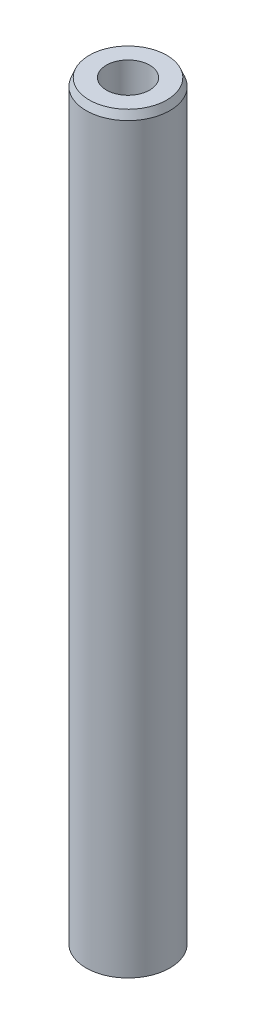
ISO-10303-21;
HEADER;
FILE_DESCRIPTION(('STEP AP214'),'2;1');
FILE_NAME('part.step','',(''),(''),'','','');
FILE_SCHEMA(('AUTOMOTIVE_DESIGN { 1 0 10303 214 1 1 1 1 }'));
ENDSEC;
DATA;
#1=APPLICATION_CONTEXT('core data for automotive mechanical design processes');
#2=APPLICATION_PROTOCOL_DEFINITION('international standard','automotive_design',2000,#1);
#3=PRODUCT_CONTEXT('',#1,'mechanical');
#4=PRODUCT('Part','Part','',(#3));
#5=PRODUCT_RELATED_PRODUCT_CATEGORY('part','',(#4));
#6=PRODUCT_DEFINITION_FORMATION('','',#4);
#7=PRODUCT_DEFINITION_CONTEXT('part definition',#1,'design');
#8=PRODUCT_DEFINITION('design','',#6,#7);
#9=PRODUCT_DEFINITION_SHAPE('','',#8);
#10=(LENGTH_UNIT() NAMED_UNIT(*) SI_UNIT(.MILLI.,.METRE.));
#11=(NAMED_UNIT(*) PLANE_ANGLE_UNIT() SI_UNIT($,.RADIAN.));
#12=(NAMED_UNIT(*) SI_UNIT($,.STERADIAN.) SOLID_ANGLE_UNIT());
#13=UNCERTAINTY_MEASURE_WITH_UNIT(LENGTH_MEASURE(1.E-05),#10,'distance_accuracy_value','');
#14=(GEOMETRIC_REPRESENTATION_CONTEXT(3) GLOBAL_UNCERTAINTY_ASSIGNED_CONTEXT((#13)) GLOBAL_UNIT_ASSIGNED_CONTEXT((#10,
#11,#12)) REPRESENTATION_CONTEXT('',''));
#15=CARTESIAN_POINT('',(0.,0.,0.));
#16=DIRECTION('',(0.,0.,1.));
#17=DIRECTION('',(1.,0.,0.));
#18=AXIS2_PLACEMENT_3D('',#15,#16,#17);
#19=CARTESIAN_POINT('',(0.,314.982312778485,0.));
#20=DIRECTION('',(0.,-1.,0.));
#21=DIRECTION('',(0.,0.,-1.));
#22=AXIS2_PLACEMENT_3D('',#19,#20,#21);
#23=CYLINDRICAL_SURFACE('',#22,17.5);
#24=CARTESIAN_POINT('',(0.,311.779967379057,0.));
#25=DIRECTION('',(0.,1.,0.));
#26=DIRECTION('',(0.,0.,1.));
#27=AXIS2_PLACEMENT_3D('',#24,#25,#26);
#28=CIRCLE('',#27,17.5);
#29=CARTESIAN_POINT('',(0.,311.779967379057,-17.5));
#30=VERTEX_POINT('',#29);
#31=EDGE_CURVE('E50',#30,#30,#28,.F.);
#32=ORIENTED_EDGE('',*,*,#31,.T.);
#33=EDGE_LOOP('',(#32));
#34=FACE_BOUND('',#33,.T.);
#35=CARTESIAN_POINT('',(0.,1.28796307959911,0.));
#36=DIRECTION('',(0.,1.,0.));
#37=DIRECTION('',(0.,0.,1.));
#38=AXIS2_PLACEMENT_3D('',#35,#36,#37);
#39=CIRCLE('',#38,17.5);
#40=CARTESIAN_POINT('',(0.,1.28796307959911,17.5));
#41=VERTEX_POINT('',#40);
#42=EDGE_CURVE('E51',#41,#41,#39,.T.);
#43=ORIENTED_EDGE('',*,*,#42,.T.);
#44=EDGE_LOOP('',(#43));
#45=FACE_BOUND('',#44,.T.);
#46=ADVANCED_FACE('F39',(#34,#45),#23,.T.);
#47=CARTESIAN_POINT('',(0.,314.982312778485,0.));
#48=DIRECTION('',(0.,1.,0.));
#49=DIRECTION('',(0.,0.,1.));
#50=AXIS2_PLACEMENT_3D('',#47,#48,#49);
#51=PLANE('',#50);
#52=CARTESIAN_POINT('',(0.,314.982312778485,0.));
#53=DIRECTION('',(0.,1.,0.));
#54=DIRECTION('',(0.,0.,1.));
#55=AXIS2_PLACEMENT_3D('',#52,#53,#54);
#56=CIRCLE('',#55,16.2120369204008);
#57=CARTESIAN_POINT('',(0.,314.982312778485,-16.2120369204008));
#58=VERTEX_POINT('',#57);
#59=EDGE_CURVE('E54',#58,#58,#56,.T.);
#60=ORIENTED_EDGE('',*,*,#59,.T.);
#61=EDGE_LOOP('',(#60));
#62=FACE_BOUND('',#61,.T.);
#63=CARTESIAN_POINT('',(0.,314.982312778485,0.));
#64=DIRECTION('',(0.,1.,0.));
#65=DIRECTION('',(0.,0.,1.));
#66=AXIS2_PLACEMENT_3D('',#63,#64,#65);
#67=CIRCLE('',#66,9.05307027082447);
#68=CARTESIAN_POINT('',(0.,314.982312778485,9.05307027082447));
#69=VERTEX_POINT('',#68);
#70=EDGE_CURVE('E58',#69,#69,#67,.T.);
#71=ORIENTED_EDGE('',*,*,#70,.F.);
#72=EDGE_LOOP('',(#71));
#73=FACE_BOUND('',#72,.T.);
#74=ADVANCED_FACE('F69',(#62,#73),#51,.T.);
#75=CARTESIAN_POINT('',(0.,0.,0.));
#76=DIRECTION('',(0.,1.,0.));
#77=DIRECTION('',(0.,0.,1.));
#78=AXIS2_PLACEMENT_3D('',#75,#76,#77);
#79=PLANE('',#78);
#80=CARTESIAN_POINT('',(0.,0.,0.));
#81=DIRECTION('',(0.,1.,0.));
#82=DIRECTION('',(0.,0.,1.));
#83=AXIS2_PLACEMENT_3D('',#80,#81,#82);
#84=CIRCLE('',#83,14.297654600573);
#85=CARTESIAN_POINT('',(0.,0.,14.297654600573));
#86=VERTEX_POINT('',#85);
#87=EDGE_CURVE('E10',#86,#86,#84,.F.);
#88=ORIENTED_EDGE('',*,*,#87,.T.);
#89=EDGE_LOOP('',(#88));
#90=FACE_BOUND('',#89,.T.);
#91=CARTESIAN_POINT('',(0.,0.,0.));
#92=DIRECTION('',(0.,1.,0.));
#93=DIRECTION('',(0.,0.,1.));
#94=AXIS2_PLACEMENT_3D('',#91,#92,#93);
#95=CIRCLE('',#94,9.05307027082447);
#96=CARTESIAN_POINT('',(0.,0.,9.05307027082447));
#97=VERTEX_POINT('',#96);
#98=EDGE_CURVE('E63',#97,#97,#95,.T.);
#99=ORIENTED_EDGE('',*,*,#98,.T.);
#100=EDGE_LOOP('',(#99));
#101=FACE_BOUND('',#100,.T.);
#102=ADVANCED_FACE('F75',(#90,#101),#79,.F.);
#103=CARTESIAN_POINT('',(0.,314.982312778485,0.));
#104=DIRECTION('',(0.,-1.,0.));
#105=DIRECTION('',(0.,0.,-1.));
#106=AXIS2_PLACEMENT_3D('',#103,#104,#105);
#107=CYLINDRICAL_SURFACE('',#106,9.05307027082447);
#108=ORIENTED_EDGE('',*,*,#70,.T.);
#109=EDGE_LOOP('',(#108));
#110=FACE_BOUND('',#109,.T.);
#111=ORIENTED_EDGE('',*,*,#98,.F.);
#112=EDGE_LOOP('',(#111));
#113=FACE_BOUND('',#112,.T.);
#114=ADVANCED_FACE('F70',(#110,#113),#107,.F.);
#115=CARTESIAN_POINT('',(0.,314.982312778485,0.));
#116=DIRECTION('',(0.,-1.,0.));
#117=DIRECTION('',(0.,0.,-1.));
#118=AXIS2_PLACEMENT_3D('',#115,#116,#117);
#119=CONICAL_SURFACE('',#118,16.2120369204008,0.382396048553831);
#120=CARTESIAN_POINT('',(0.,311.779967379057,-17.5));
#121=CARTESIAN_POINT('',(0.,311.813325143635,-17.4865837179209));
#122=CARTESIAN_POINT('',(0.,311.846682908212,-17.4731674358417));
#123=CARTESIAN_POINT('',(0.,311.913398437367,-17.4463348716834));
#124=CARTESIAN_POINT('',(0.,311.946756201944,-17.4329185896042));
#125=CARTESIAN_POINT('',(0.,312.013471731099,-17.4060860254459));
#126=CARTESIAN_POINT('',(0.,312.046829495676,-17.3926697433667));
#127=CARTESIAN_POINT('',(0.,312.113545024831,-17.3658371792084));
#128=CARTESIAN_POINT('',(0.,312.146902789409,-17.3524208971293));
#129=CARTESIAN_POINT('',(0.,312.213618318563,-17.325588332971));
#130=CARTESIAN_POINT('',(0.,312.246976083141,-17.3121720508918));
#131=CARTESIAN_POINT('',(0.,312.313691612295,-17.2853394867335));
#132=CARTESIAN_POINT('',(0.,312.347049376873,-17.2719232046543));
#133=CARTESIAN_POINT('',(0.,312.413764906027,-17.245090640496));
#134=CARTESIAN_POINT('',(0.,312.447122670605,-17.2316743584168));
#135=CARTESIAN_POINT('',(0.,312.51383819976,-17.2048417942585));
#136=CARTESIAN_POINT('',(0.,312.547195964337,-17.1914255121794));
#137=CARTESIAN_POINT('',(0.,312.613911493492,-17.1645929480211));
#138=CARTESIAN_POINT('',(0.,312.647269258069,-17.1511766659419));
#139=CARTESIAN_POINT('',(0.,312.713984787224,-17.1243441017836));
#140=CARTESIAN_POINT('',(0.,312.747342551801,-17.1109278197044));
#141=CARTESIAN_POINT('',(0.,312.814058080956,-17.0840952555461));
#142=CARTESIAN_POINT('',(0.,312.847415845533,-17.0706789734669));
#143=CARTESIAN_POINT('',(0.,312.914131374688,-17.0438464093086));
#144=CARTESIAN_POINT('',(0.,312.947489139265,-17.0304301272295));
#145=CARTESIAN_POINT('',(0.,313.01420466842,-17.0035975630711));
#146=CARTESIAN_POINT('',(0.,313.047562432997,-16.990181280992));
#147=CARTESIAN_POINT('',(0.,313.114277962152,-16.9633487168337));
#148=CARTESIAN_POINT('',(0.,313.14763572673,-16.9499324347545));
#149=CARTESIAN_POINT('',(0.,313.214351255884,-16.9230998705962));
#150=CARTESIAN_POINT('',(0.,313.247709020462,-16.909683588517));
#151=CARTESIAN_POINT('',(0.,313.314424549616,-16.8828510243587));
#152=CARTESIAN_POINT('',(0.,313.347782314194,-16.8694347422796));
#153=CARTESIAN_POINT('',(0.,313.414497843348,-16.8426021781213));
#154=CARTESIAN_POINT('',(0.,313.447855607926,-16.8291858960421));
#155=CARTESIAN_POINT('',(0.,313.51457113708,-16.8023533318838));
#156=CARTESIAN_POINT('',(0.,313.547928901658,-16.7889370498046));
#157=CARTESIAN_POINT('',(0.,313.614644430813,-16.7621044856463));
#158=CARTESIAN_POINT('',(0.,313.64800219539,-16.7486882035671));
#159=CARTESIAN_POINT('',(0.,313.714717724545,-16.7218556394088));
#160=CARTESIAN_POINT('',(0.,313.748075489122,-16.7084393573297));
#161=CARTESIAN_POINT('',(0.,313.814791018277,-16.6816067931714));
#162=CARTESIAN_POINT('',(0.,313.848148782854,-16.6681905110922));
#163=CARTESIAN_POINT('',(0.,313.914864312009,-16.6413579469339));
#164=CARTESIAN_POINT('',(0.,313.948222076586,-16.6279416648547));
#165=CARTESIAN_POINT('',(0.,314.014937605741,-16.6011091006964));
#166=CARTESIAN_POINT('',(0.,314.048295370318,-16.5876928186172));
#167=CARTESIAN_POINT('',(0.,314.115010899473,-16.5608602544589));
#168=CARTESIAN_POINT('',(0.,314.148368664051,-16.5474439723798));
#169=CARTESIAN_POINT('',(0.,314.215084193205,-16.5206114082215));
#170=CARTESIAN_POINT('',(0.,314.248441957783,-16.5071951261423));
#171=CARTESIAN_POINT('',(0.,314.315157486937,-16.480362561984));
#172=CARTESIAN_POINT('',(0.,314.348515251515,-16.4669462799048));
#173=CARTESIAN_POINT('',(0.,314.415230780669,-16.4401137157465));
#174=CARTESIAN_POINT('',(0.,314.448588545247,-16.4266974336673));
#175=CARTESIAN_POINT('',(0.,314.515304074401,-16.399864869509));
#176=CARTESIAN_POINT('',(0.,314.548661838979,-16.3864485874299));
#177=CARTESIAN_POINT('',(0.,314.615377368134,-16.3596160232716));
#178=CARTESIAN_POINT('',(0.,314.648735132711,-16.3461997411924));
#179=CARTESIAN_POINT('',(0.,314.715450661866,-16.3193671770341));
#180=CARTESIAN_POINT('',(0.,314.748808426443,-16.3059508949549));
#181=CARTESIAN_POINT('',(0.,314.815523955598,-16.2791183307966));
#182=CARTESIAN_POINT('',(0.,314.848881720175,-16.2657020487174));
#183=CARTESIAN_POINT('',(0.,314.91559724933,-16.2388694845591));
#184=CARTESIAN_POINT('',(0.,314.948955013907,-16.22545320248));
#185=CARTESIAN_POINT('',(0.,314.982312778485,-16.2120369204008));
#186=B_SPLINE_CURVE_WITH_KNOTS('',3,(#120,#121,#122,#123,#124,#125,#126,#127,#128,#129,#130,
#131,#132,#133,#134,#135,#136,#137,#138,#139,#140,#141,#142,#143,#144,#145,#146,#147,#148,#149,
#150,#151,#152,#153,#154,#155,#156,#157,#158,#159,#160,#161,#162,#163,#164,#165,#166,#167,#168,
#169,#170,#171,#172,#173,#174,#175,#176,#177,#178,#179,#180,#181,#182,#183,#184,#185),
.UNSPECIFIED.,.F.,.F.,(4,2,2,2,2,2,2,2,2,2,2,2,2,2,2,2,2,2,2,2,2,2,2,2,2,2,2,2,2,2,2,2,4),(0.,
0.107863959420344,0.215727918840688,0.323591878261084,0.431455837681426,0.539319797101822,
0.647183756522166,0.755047715942561,0.862911675362905,0.970775634783301,1.07863959420364,
1.18650355362404,1.29436751304438,1.40223147246478,1.51009543188512,1.61795939130552,
1.72582335072586,1.83368731014621,1.9415512695666,2.04941522898695,2.15727918840734,
2.26514314782769,2.37300710724808,2.48087106666843,2.58873502608882,2.69659898550916,
2.80446294492956,2.9123269043499,3.0201908637703,3.12805482319064,3.23591878261104,
3.34378274203138,3.45164670145178),.UNSPECIFIED.);
#187=EDGE_CURVE('BSEAM81',#30,#58,#186,.T.);
#188=ORIENTED_EDGE('',*,*,#31,.F.);
#189=ORIENTED_EDGE('',*,*,#59,.F.);
#190=ORIENTED_EDGE('',*,*,#187,.T.);
#191=ORIENTED_EDGE('',*,*,#187,.F.);
#192=EDGE_LOOP('',(#188,#190,#189,#191));
#193=FACE_BOUND('',#192,.T.);
#194=ADVANCED_FACE('F81',(#193),#119,.T.);
#195=CARTESIAN_POINT('',(0.,1.28796307959911,0.));
#196=DIRECTION('',(0.,1.,0.));
#197=DIRECTION('',(0.,0.,1.));
#198=AXIS2_PLACEMENT_3D('',#195,#196,#197);
#199=CONICAL_SURFACE('',#198,17.5,1.18840027824107);
#200=ORIENTED_EDGE('',*,*,#87,.F.);
#201=EDGE_LOOP('',(#200));
#202=FACE_BOUND('',#201,.T.);
#203=ORIENTED_EDGE('',*,*,#42,.F.);
#204=EDGE_LOOP('',(#203));
#205=FACE_BOUND('',#204,.T.);
#206=ADVANCED_FACE('F45',(#202,#205),#199,.T.);
#207=CLOSED_SHELL('',(#46,#74,#102,#114,#194,#206));
#208=MANIFOLD_SOLID_BREP('B2',#207);
#209=ADVANCED_BREP_SHAPE_REPRESENTATION('',(#18,#208),#14);
#210=SHAPE_DEFINITION_REPRESENTATION(#9,#209);
ENDSEC;
END-ISO-10303-21;
